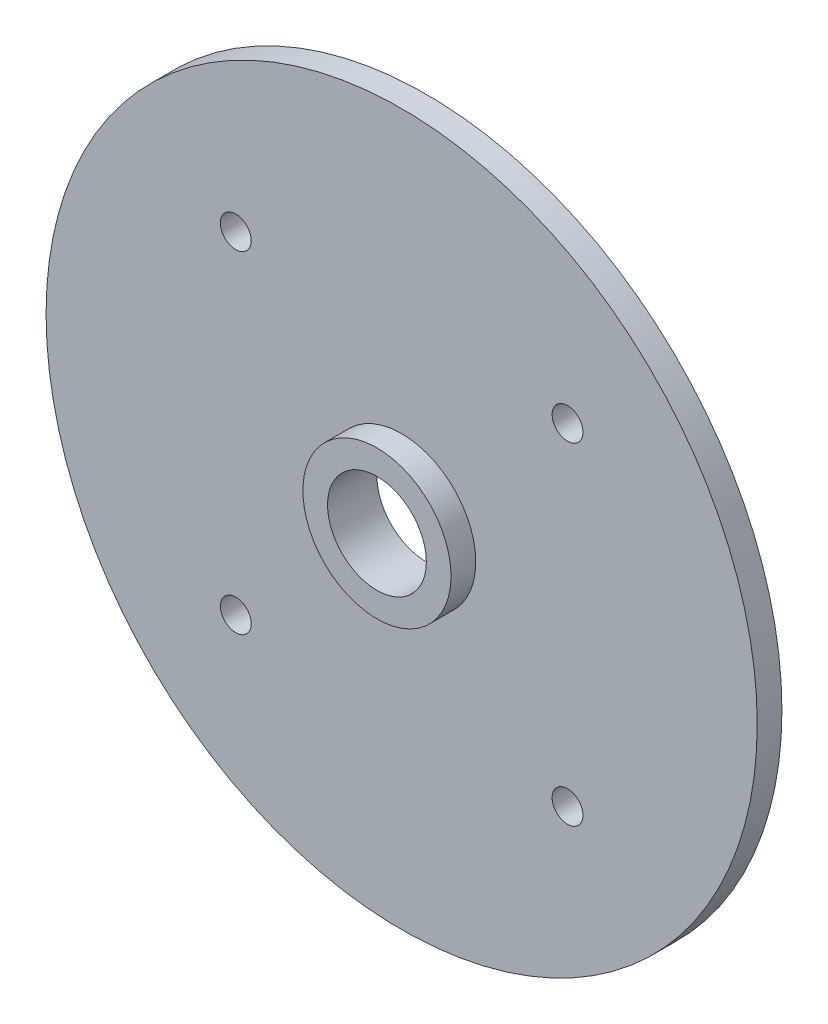
ISO-10303-21;
HEADER;
FILE_DESCRIPTION(('STEP AP214'),'2;1');
FILE_NAME('part.step','',(''),(''),'','','');
FILE_SCHEMA(('AUTOMOTIVE_DESIGN { 1 0 10303 214 1 1 1 1 }'));
ENDSEC;
DATA;
#1=APPLICATION_CONTEXT('core data for automotive mechanical design processes');
#2=APPLICATION_PROTOCOL_DEFINITION('international standard','automotive_design',2000,#1);
#3=PRODUCT_CONTEXT('',#1,'mechanical');
#4=PRODUCT('Part','Part','',(#3));
#5=PRODUCT_RELATED_PRODUCT_CATEGORY('part','',(#4));
#6=PRODUCT_DEFINITION_FORMATION('','',#4);
#7=PRODUCT_DEFINITION_CONTEXT('part definition',#1,'design');
#8=PRODUCT_DEFINITION('design','',#6,#7);
#9=PRODUCT_DEFINITION_SHAPE('','',#8);
#10=(LENGTH_UNIT() NAMED_UNIT(*) SI_UNIT(.MILLI.,.METRE.));
#11=(NAMED_UNIT(*) PLANE_ANGLE_UNIT() SI_UNIT($,.RADIAN.));
#12=(NAMED_UNIT(*) SI_UNIT($,.STERADIAN.) SOLID_ANGLE_UNIT());
#13=UNCERTAINTY_MEASURE_WITH_UNIT(LENGTH_MEASURE(1.E-05),#10,'distance_accuracy_value','');
#14=(GEOMETRIC_REPRESENTATION_CONTEXT(3) GLOBAL_UNCERTAINTY_ASSIGNED_CONTEXT((#13)) GLOBAL_UNIT_ASSIGNED_CONTEXT((#10,
#11,#12)) REPRESENTATION_CONTEXT('',''));
#15=CARTESIAN_POINT('',(0.,0.,0.));
#16=DIRECTION('',(0.,0.,1.));
#17=DIRECTION('',(1.,0.,0.));
#18=AXIS2_PLACEMENT_3D('',#15,#16,#17);
#19=CARTESIAN_POINT('',(0.,-108.5,-2.));
#20=DIRECTION('',(0.,0.,1.));
#21=DIRECTION('',(1.,0.,0.));
#22=AXIS2_PLACEMENT_3D('',#19,#20,#21);
#23=CYLINDRICAL_SURFACE('',#22,6.);
#24=CARTESIAN_POINT('',(0.,-108.5,-2.));
#25=DIRECTION('',(0.,0.,1.));
#26=DIRECTION('',(1.,0.,0.));
#27=AXIS2_PLACEMENT_3D('',#24,#25,#26);
#28=CIRCLE('',#27,6.);
#29=CARTESIAN_POINT('',(6.00000000000002,-108.5,-2.));
#30=VERTEX_POINT('',#29);
#31=EDGE_CURVE('E45',#30,#30,#28,.T.);
#32=ORIENTED_EDGE('',*,*,#31,.T.);
#33=EDGE_LOOP('',(#32));
#34=FACE_BOUND('',#33,.T.);
#35=CARTESIAN_POINT('',(0.,-108.5,0.));
#36=DIRECTION('',(0.,0.,1.));
#37=DIRECTION('',(1.,0.,0.));
#38=AXIS2_PLACEMENT_3D('',#35,#36,#37);
#39=CIRCLE('',#38,6.);
#40=CARTESIAN_POINT('',(6.00000000000002,-108.5,0.));
#41=VERTEX_POINT('',#40);
#42=EDGE_CURVE('E10',#41,#41,#39,.T.);
#43=ORIENTED_EDGE('',*,*,#42,.F.);
#44=EDGE_LOOP('',(#43));
#45=FACE_BOUND('',#44,.T.);
#46=ADVANCED_FACE('F38',(#34,#45),#23,.T.);
#47=CARTESIAN_POINT('',(0.,-108.5,0.));
#48=DIRECTION('',(0.,0.,1.));
#49=DIRECTION('',(1.,0.,0.));
#50=AXIS2_PLACEMENT_3D('',#47,#48,#49);
#51=PLANE('',#50);
#52=CARTESIAN_POINT('',(0.,-108.5,0.));
#53=DIRECTION('',(0.,0.,1.));
#54=DIRECTION('',(1.,0.,0.));
#55=AXIS2_PLACEMENT_3D('',#52,#53,#54);
#56=CIRCLE('',#55,4.);
#57=CARTESIAN_POINT('',(4.00000000000002,-108.5,0.));
#58=VERTEX_POINT('',#57);
#59=EDGE_CURVE('E64',#58,#58,#56,.T.);
#60=ORIENTED_EDGE('',*,*,#59,.F.);
#61=EDGE_LOOP('',(#60));
#62=FACE_BOUND('',#61,.T.);
#63=ORIENTED_EDGE('',*,*,#42,.T.);
#64=EDGE_LOOP('',(#63));
#65=FACE_BOUND('',#64,.T.);
#66=ADVANCED_FACE('F117',(#62,#65),#51,.T.);
#67=CARTESIAN_POINT('',(0.,-108.5,-4.));
#68=DIRECTION('',(0.,0.,1.));
#69=DIRECTION('',(1.,0.,0.));
#70=AXIS2_PLACEMENT_3D('',#67,#68,#69);
#71=CYLINDRICAL_SURFACE('',#70,28.8);
#72=CARTESIAN_POINT('',(0.,-108.5,-4.));
#73=DIRECTION('',(0.,0.,-1.));
#74=DIRECTION('',(-1.,0.,0.));
#75=AXIS2_PLACEMENT_3D('',#72,#73,#74);
#76=CIRCLE('',#75,28.8);
#77=CARTESIAN_POINT('',(-28.8,-108.5,-4.));
#78=VERTEX_POINT('',#77);
#79=EDGE_CURVE('E52',#78,#78,#76,.T.);
#80=ORIENTED_EDGE('',*,*,#79,.F.);
#81=EDGE_LOOP('',(#80));
#82=FACE_BOUND('',#81,.T.);
#83=CARTESIAN_POINT('',(0.,-108.5,-2.));
#84=DIRECTION('',(0.,0.,-1.));
#85=DIRECTION('',(-1.,0.,0.));
#86=AXIS2_PLACEMENT_3D('',#83,#84,#85);
#87=CIRCLE('',#86,28.8);
#88=CARTESIAN_POINT('',(-28.8,-108.5,-2.));
#89=VERTEX_POINT('',#88);
#90=EDGE_CURVE('E57',#89,#89,#87,.T.);
#91=ORIENTED_EDGE('',*,*,#90,.T.);
#92=EDGE_LOOP('',(#91));
#93=FACE_BOUND('',#92,.T.);
#94=ADVANCED_FACE('F115',(#82,#93),#71,.T.);
#95=CARTESIAN_POINT('',(0.,-108.5,-4.));
#96=DIRECTION('',(0.,0.,-1.));
#97=DIRECTION('',(-1.,0.,0.));
#98=AXIS2_PLACEMENT_3D('',#95,#96,#97);
#99=PLANE('',#98);
#100=CARTESIAN_POINT('',(-13.4350288425441,-95.0649711574553,-4.));
#101=DIRECTION('',(0.,0.,1.));
#102=DIRECTION('',(1.,0.,0.));
#103=AXIS2_PLACEMENT_3D('',#100,#101,#102);
#104=CIRCLE('',#103,1.25);
#105=CARTESIAN_POINT('',(-12.1850288425441,-95.0649711574553,-4.));
#106=VERTEX_POINT('',#105);
#107=EDGE_CURVE('E89',#106,#106,#104,.T.);
#108=ORIENTED_EDGE('',*,*,#107,.T.);
#109=EDGE_LOOP('',(#108));
#110=FACE_BOUND('',#109,.T.);
#111=CARTESIAN_POINT('',(13.4350288425445,-95.0649711574557,-4.));
#112=DIRECTION('',(0.,0.,1.));
#113=DIRECTION('',(1.,0.,0.));
#114=AXIS2_PLACEMENT_3D('',#111,#112,#113);
#115=CIRCLE('',#114,1.25);
#116=CARTESIAN_POINT('',(14.6850288425445,-95.0649711574557,-4.));
#117=VERTEX_POINT('',#116);
#118=EDGE_CURVE('E83',#117,#117,#115,.T.);
#119=ORIENTED_EDGE('',*,*,#118,.T.);
#120=EDGE_LOOP('',(#119));
#121=FACE_BOUND('',#120,.T.);
#122=CARTESIAN_POINT('',(13.4350288425443,-121.935028842545,-4.));
#123=DIRECTION('',(0.,0.,1.));
#124=DIRECTION('',(1.,0.,0.));
#125=AXIS2_PLACEMENT_3D('',#122,#123,#124);
#126=CIRCLE('',#125,1.25);
#127=CARTESIAN_POINT('',(14.6850288425443,-121.935028842545,-4.));
#128=VERTEX_POINT('',#127);
#129=EDGE_CURVE('E77',#128,#128,#126,.T.);
#130=ORIENTED_EDGE('',*,*,#129,.T.);
#131=EDGE_LOOP('',(#130));
#132=FACE_BOUND('',#131,.T.);
#133=CARTESIAN_POINT('',(-13.4350288425446,-121.935028842544,-4.));
#134=DIRECTION('',(0.,0.,1.));
#135=DIRECTION('',(1.,0.,0.));
#136=AXIS2_PLACEMENT_3D('',#133,#134,#135);
#137=CIRCLE('',#136,1.25);
#138=CARTESIAN_POINT('',(-12.1850288425446,-121.935028842544,-4.));
#139=VERTEX_POINT('',#138);
#140=EDGE_CURVE('E67',#139,#139,#137,.T.);
#141=ORIENTED_EDGE('',*,*,#140,.T.);
#142=EDGE_LOOP('',(#141));
#143=FACE_BOUND('',#142,.T.);
#144=CARTESIAN_POINT('',(0.,-108.5,-4.));
#145=DIRECTION('',(0.,0.,1.));
#146=DIRECTION('',(1.,0.,0.));
#147=AXIS2_PLACEMENT_3D('',#144,#145,#146);
#148=CIRCLE('',#147,4.);
#149=CARTESIAN_POINT('',(4.00000000000002,-108.5,-4.));
#150=VERTEX_POINT('',#149);
#151=EDGE_CURVE('E62',#150,#150,#148,.T.);
#152=ORIENTED_EDGE('',*,*,#151,.T.);
#153=EDGE_LOOP('',(#152));
#154=FACE_BOUND('',#153,.T.);
#155=ORIENTED_EDGE('',*,*,#79,.T.);
#156=EDGE_LOOP('',(#155));
#157=FACE_BOUND('',#156,.T.);
#158=ADVANCED_FACE('F104',(#110,#121,#132,#143,#154,#157),#99,.T.);
#159=CARTESIAN_POINT('',(0.,-108.5,-2.));
#160=DIRECTION('',(0.,0.,-1.));
#161=DIRECTION('',(-1.,0.,0.));
#162=AXIS2_PLACEMENT_3D('',#159,#160,#161);
#163=PLANE('',#162);
#164=CARTESIAN_POINT('',(-13.4350288425441,-95.0649711574553,-2.));
#165=DIRECTION('',(0.,0.,1.));
#166=DIRECTION('',(1.,0.,0.));
#167=AXIS2_PLACEMENT_3D('',#164,#165,#166);
#168=CIRCLE('',#167,1.24999999999999);
#169=CARTESIAN_POINT('',(-12.1850288425442,-95.0649711574553,-2.));
#170=VERTEX_POINT('',#169);
#171=EDGE_CURVE('E93',#170,#170,#168,.T.);
#172=ORIENTED_EDGE('',*,*,#171,.F.);
#173=EDGE_LOOP('',(#172));
#174=FACE_BOUND('',#173,.T.);
#175=CARTESIAN_POINT('',(13.4350288425445,-95.0649711574557,-2.));
#176=DIRECTION('',(0.,0.,1.));
#177=DIRECTION('',(1.,0.,0.));
#178=AXIS2_PLACEMENT_3D('',#175,#176,#177);
#179=CIRCLE('',#178,1.24999999999999);
#180=CARTESIAN_POINT('',(14.6850288425445,-95.0649711574557,-2.));
#181=VERTEX_POINT('',#180);
#182=EDGE_CURVE('E86',#181,#181,#179,.T.);
#183=ORIENTED_EDGE('',*,*,#182,.F.);
#184=EDGE_LOOP('',(#183));
#185=FACE_BOUND('',#184,.T.);
#186=CARTESIAN_POINT('',(13.4350288425443,-121.935028842545,-2.));
#187=DIRECTION('',(0.,0.,1.));
#188=DIRECTION('',(1.,0.,0.));
#189=AXIS2_PLACEMENT_3D('',#186,#187,#188);
#190=CIRCLE('',#189,1.24999999999999);
#191=CARTESIAN_POINT('',(14.6850288425442,-121.935028842545,-2.));
#192=VERTEX_POINT('',#191);
#193=EDGE_CURVE('E80',#192,#192,#190,.T.);
#194=ORIENTED_EDGE('',*,*,#193,.F.);
#195=EDGE_LOOP('',(#194));
#196=FACE_BOUND('',#195,.T.);
#197=CARTESIAN_POINT('',(-13.4350288425446,-121.935028842544,-2.));
#198=DIRECTION('',(0.,0.,1.));
#199=DIRECTION('',(1.,0.,0.));
#200=AXIS2_PLACEMENT_3D('',#197,#198,#199);
#201=CIRCLE('',#200,1.24999999999999);
#202=CARTESIAN_POINT('',(-12.1850288425446,-121.935028842544,-2.));
#203=VERTEX_POINT('',#202);
#204=EDGE_CURVE('E73',#203,#203,#201,.T.);
#205=ORIENTED_EDGE('',*,*,#204,.F.);
#206=EDGE_LOOP('',(#205));
#207=FACE_BOUND('',#206,.T.);
#208=ORIENTED_EDGE('',*,*,#31,.F.);
#209=EDGE_LOOP('',(#208));
#210=FACE_BOUND('',#209,.T.);
#211=ORIENTED_EDGE('',*,*,#90,.F.);
#212=EDGE_LOOP('',(#211));
#213=FACE_BOUND('',#212,.T.);
#214=ADVANCED_FACE('F100',(#174,#185,#196,#207,#210,#213),#163,.F.);
#215=CARTESIAN_POINT('',(0.,-108.5,-4.));
#216=DIRECTION('',(0.,0.,1.));
#217=DIRECTION('',(1.,0.,0.));
#218=AXIS2_PLACEMENT_3D('',#215,#216,#217);
#219=CYLINDRICAL_SURFACE('',#218,4.);
#220=ORIENTED_EDGE('',*,*,#151,.F.);
#221=EDGE_LOOP('',(#220));
#222=FACE_BOUND('',#221,.T.);
#223=ORIENTED_EDGE('',*,*,#59,.T.);
#224=EDGE_LOOP('',(#223));
#225=FACE_BOUND('',#224,.T.);
#226=ADVANCED_FACE('F103',(#222,#225),#219,.F.);
#227=CARTESIAN_POINT('',(-13.4350288425446,-121.935028842544,-2.));
#228=DIRECTION('',(0.,0.,1.));
#229=DIRECTION('',(1.,0.,0.));
#230=AXIS2_PLACEMENT_3D('',#227,#228,#229);
#231=CYLINDRICAL_SURFACE('',#230,1.24999999999999);
#232=ORIENTED_EDGE('',*,*,#140,.F.);
#233=EDGE_LOOP('',(#232));
#234=FACE_BOUND('',#233,.T.);
#235=ORIENTED_EDGE('',*,*,#204,.T.);
#236=EDGE_LOOP('',(#235));
#237=FACE_BOUND('',#236,.T.);
#238=ADVANCED_FACE('F147',(#234,#237),#231,.F.);
#239=CARTESIAN_POINT('',(13.4350288425443,-121.935028842545,-2.));
#240=DIRECTION('',(0.,0.,1.));
#241=DIRECTION('',(1.,0.,0.));
#242=AXIS2_PLACEMENT_3D('',#239,#240,#241);
#243=CYLINDRICAL_SURFACE('',#242,1.24999999999999);
#244=ORIENTED_EDGE('',*,*,#129,.F.);
#245=EDGE_LOOP('',(#244));
#246=FACE_BOUND('',#245,.T.);
#247=ORIENTED_EDGE('',*,*,#193,.T.);
#248=EDGE_LOOP('',(#247));
#249=FACE_BOUND('',#248,.T.);
#250=ADVANCED_FACE('F170',(#246,#249),#243,.F.);
#251=CARTESIAN_POINT('',(13.4350288425445,-95.0649711574557,-2.));
#252=DIRECTION('',(0.,0.,1.));
#253=DIRECTION('',(1.,0.,0.));
#254=AXIS2_PLACEMENT_3D('',#251,#252,#253);
#255=CYLINDRICAL_SURFACE('',#254,1.24999999999999);
#256=ORIENTED_EDGE('',*,*,#118,.F.);
#257=EDGE_LOOP('',(#256));
#258=FACE_BOUND('',#257,.T.);
#259=ORIENTED_EDGE('',*,*,#182,.T.);
#260=EDGE_LOOP('',(#259));
#261=FACE_BOUND('',#260,.T.);
#262=ADVANCED_FACE('F181',(#258,#261),#255,.F.);
#263=CARTESIAN_POINT('',(-13.4350288425441,-95.0649711574553,-2.));
#264=DIRECTION('',(0.,0.,1.));
#265=DIRECTION('',(1.,0.,0.));
#266=AXIS2_PLACEMENT_3D('',#263,#264,#265);
#267=CYLINDRICAL_SURFACE('',#266,1.24999999999999);
#268=ORIENTED_EDGE('',*,*,#107,.F.);
#269=EDGE_LOOP('',(#268));
#270=FACE_BOUND('',#269,.T.);
#271=ORIENTED_EDGE('',*,*,#171,.T.);
#272=EDGE_LOOP('',(#271));
#273=FACE_BOUND('',#272,.T.);
#274=ADVANCED_FACE('F98',(#270,#273),#267,.F.);
#275=CLOSED_SHELL('',(#46,#66,#94,#158,#214,#226,#238,#250,#262,#274));
#276=MANIFOLD_SOLID_BREP('B2',#275);
#277=ADVANCED_BREP_SHAPE_REPRESENTATION('',(#18,#276),#14);
#278=SHAPE_DEFINITION_REPRESENTATION(#9,#277);
ENDSEC;
END-ISO-10303-21;
